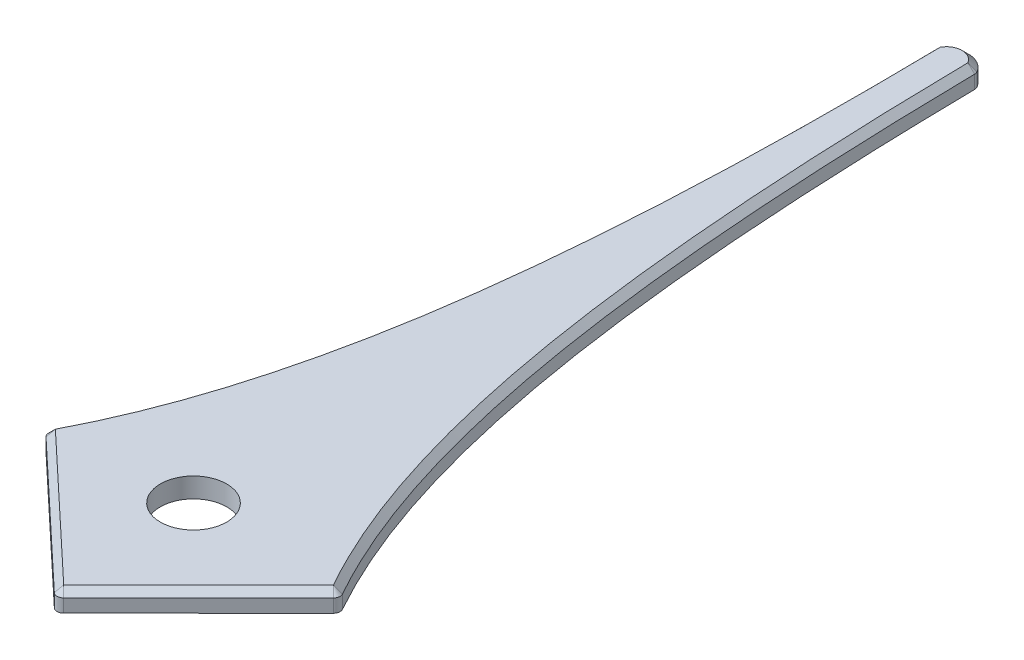
ISO-10303-21;
HEADER;
FILE_DESCRIPTION(('STEP AP214'),'2;1');
FILE_NAME('part.step','',(''),(''),'','','');
FILE_SCHEMA(('AUTOMOTIVE_DESIGN { 1 0 10303 214 1 1 1 1 }'));
ENDSEC;
DATA;
#1=APPLICATION_CONTEXT('core data for automotive mechanical design processes');
#2=APPLICATION_PROTOCOL_DEFINITION('international standard','automotive_design',2000,#1);
#3=PRODUCT_CONTEXT('',#1,'mechanical');
#4=PRODUCT('Part','Part','',(#3));
#5=PRODUCT_RELATED_PRODUCT_CATEGORY('part','',(#4));
#6=PRODUCT_DEFINITION_FORMATION('','',#4);
#7=PRODUCT_DEFINITION_CONTEXT('part definition',#1,'design');
#8=PRODUCT_DEFINITION('design','',#6,#7);
#9=PRODUCT_DEFINITION_SHAPE('','',#8);
#10=(LENGTH_UNIT() NAMED_UNIT(*) SI_UNIT(.MILLI.,.METRE.));
#11=(NAMED_UNIT(*) PLANE_ANGLE_UNIT() SI_UNIT($,.RADIAN.));
#12=(NAMED_UNIT(*) SI_UNIT($,.STERADIAN.) SOLID_ANGLE_UNIT());
#13=UNCERTAINTY_MEASURE_WITH_UNIT(LENGTH_MEASURE(1.E-05),#10,'distance_accuracy_value','');
#14=(GEOMETRIC_REPRESENTATION_CONTEXT(3) GLOBAL_UNCERTAINTY_ASSIGNED_CONTEXT((#13)) GLOBAL_UNIT_ASSIGNED_CONTEXT((#10,
#11,#12)) REPRESENTATION_CONTEXT('',''));
#15=CARTESIAN_POINT('',(0.,0.,0.));
#16=DIRECTION('',(0.,0.,1.));
#17=DIRECTION('',(1.,0.,0.));
#18=AXIS2_PLACEMENT_3D('',#15,#16,#17);
#19=CARTESIAN_POINT('',(-0.84427339324463,0.781119019034748,10.3159980699105));
#20=CARTESIAN_POINT('',(-0.482807728251816,0.781119019034748,9.63484541938807));
#21=CARTESIAN_POINT('',(-0.316238720875581,0.781119019034748,8.60682836334096));
#22=CARTESIAN_POINT('',(-0.344928680809462,0.781119019034748,6.89122524216324));
#23=B_SPLINE_CURVE_WITH_KNOTS('',3,(#19,#20,#21,#22),.UNSPECIFIED.,.F.,.F.,(4,4),(0.,1.),.UNSPECIFIED.);
#24=DIRECTION('',(0.,-1.,0.));
#25=VECTOR('',#24,1.);
#26=SURFACE_OF_LINEAR_EXTRUSION('',#23,#25);
#27=DIRECTION('',(0.,-1.,0.));
#28=VECTOR('',#27,1.);
#29=CARTESIAN_POINT('',(-0.833990106525606,0.693399019034748,10.2964251031646));
#30=LINE('',#29,#28);
#31=CARTESIAN_POINT('',(-0.833990106525606,0.693399019034748,10.2964251031646));
#32=VERTEX_POINT('',#31);
#33=CARTESIAN_POINT('',(-0.833990106525606,0.751879019034748,10.2964251031646));
#34=VERTEX_POINT('',#33);
#35=EDGE_CURVE('E183',#32,#34,#30,.F.);
#36=ORIENTED_EDGE('',*,*,#35,.T.);
#37=CARTESIAN_POINT('',(-0.833990106525606,0.751879019034749,10.2964251031646));
#38=CARTESIAN_POINT('',(-0.480137373854941,0.751879019034749,9.6161219200585));
#39=CARTESIAN_POINT('',(-0.316961311436214,0.751879019034749,8.59329344205403));
#40=CARTESIAN_POINT('',(-0.344812516242735,0.751879019034749,6.89823283345259));
#41=B_SPLINE_CURVE_WITH_KNOTS('',3,(#37,#38,#39,#40),.UNSPECIFIED.,.F.,.F.,(4,4),
(0.00953194338408838,0.998637715516818),.UNSPECIFIED.);
#42=CARTESIAN_POINT('',(-0.344812516242735,0.751879019034748,6.89823283345259));
#43=VERTEX_POINT('',#42);
#44=EDGE_CURVE('E487',#34,#43,#41,.T.);
#45=ORIENTED_EDGE('',*,*,#44,.T.);
#46=DIRECTION('',(0.,-1.,0.));
#47=VECTOR('',#46,1.);
#48=CARTESIAN_POINT('',(-0.344812516242735,0.781119019034748,6.89823283345259));
#49=LINE('',#48,#47);
#50=CARTESIAN_POINT('',(-0.344812516242735,0.693399019034748,6.89823283345259));
#51=VERTEX_POINT('',#50);
#52=EDGE_CURVE('E489',#43,#51,#49,.T.);
#53=ORIENTED_EDGE('',*,*,#52,.T.);
#54=CARTESIAN_POINT('',(-0.84427339324463,0.693399019034748,10.3159980699105));
#55=CARTESIAN_POINT('',(-0.482807728251816,0.693399019034748,9.63484541938807));
#56=CARTESIAN_POINT('',(-0.316238720875581,0.693399019034748,8.60682836334096));
#57=CARTESIAN_POINT('',(-0.344928680809462,0.693399019034748,6.89122524216324));
#58=B_SPLINE_CURVE_WITH_KNOTS('',3,(#54,#55,#56,#57),.UNSPECIFIED.,.F.,.F.,(4,4),(0.,1.),.UNSPECIFIED.);
#59=EDGE_CURVE('E138',#32,#51,#58,.T.);
#60=ORIENTED_EDGE('',*,*,#59,.F.);
#61=EDGE_LOOP('',(#36,#45,#53,#60));
#62=FACE_BOUND('',#61,.T.);
#63=ADVANCED_FACE('F36',(#62),#26,.T.);
#64=CARTESIAN_POINT('',(-2.99700158061435,0.781119019034748,8.29250056360764));
#65=DIRECTION('',(-0.684897970978588,0.,0.728638984236647));
#66=DIRECTION('',(0.728638984236647,0.,0.684897970978588));
#67=AXIS2_PLACEMENT_3D('',#64,#65,#66);
#68=PLANE('',#67);
#69=DIRECTION('',(0.,-1.,0.));
#70=VECTOR('',#69,1.);
#71=CARTESIAN_POINT('',(-0.214885813562541,0.781119019034748,10.9076028091697));
#72=LINE('',#71,#70);
#73=CARTESIAN_POINT('',(-0.214885813562542,0.693399019034748,10.9076028091697));
#74=VERTEX_POINT('',#73);
#75=CARTESIAN_POINT('',(-0.214885813562541,0.751879019034748,10.9076028091697));
#76=VERTEX_POINT('',#75);
#77=EDGE_CURVE('E491',#74,#76,#72,.F.);
#78=ORIENTED_EDGE('',*,*,#77,.T.);
#79=DIRECTION('',(-0.728638984236647,0.,-0.684897970978588));
#80=VECTOR('',#79,1.);
#81=CARTESIAN_POINT('',(-2.99700158061435,0.751879019034747,8.29250056360764));
#82=LINE('',#81,#80);
#83=CARTESIAN_POINT('',(-0.828075788039018,0.751879019034747,10.3312233147575));
#84=VERTEX_POINT('',#83);
#85=EDGE_CURVE('E430',#76,#84,#82,.T.);
#86=ORIENTED_EDGE('',*,*,#85,.T.);
#87=DIRECTION('',(0.,-1.,0.));
#88=VECTOR('',#87,1.);
#89=CARTESIAN_POINT('',(-0.828075788039018,0.781119019034748,10.3312233147575));
#90=LINE('',#89,#88);
#91=CARTESIAN_POINT('',(-0.828075788039018,0.693399019034748,10.3312233147575));
#92=VERTEX_POINT('',#91);
#93=EDGE_CURVE('E504',#84,#92,#90,.T.);
#94=ORIENTED_EDGE('',*,*,#93,.T.);
#95=DIRECTION('',(-0.728638984236647,0.,-0.684897970978588));
#96=VECTOR('',#95,1.);
#97=CARTESIAN_POINT('',(-2.99700158061435,0.693399019034748,8.29250056360764));
#98=LINE('',#97,#96);
#99=EDGE_CURVE('E222',#74,#92,#98,.T.);
#100=ORIENTED_EDGE('',*,*,#99,.F.);
#101=EDGE_LOOP('',(#78,#86,#94,#100));
#102=FACE_BOUND('',#101,.T.);
#103=ADVANCED_FACE('F508',(#102),#68,.T.);
#104=CARTESIAN_POINT('',(-0.850072535414796,0.781119019034748,11.5820228825341));
#105=DIRECTION('',(-0.706667353058945,0.,-0.707545936403188));
#106=DIRECTION('',(-0.707545936403188,0.,0.706667353058945));
#107=AXIS2_PLACEMENT_3D('',#104,#105,#106);
#108=PLANE('',#107);
#109=DIRECTION('',(0.,-1.,0.));
#110=VECTOR('',#109,1.);
#111=CARTESIAN_POINT('',(0.421242565500472,0.781119019034748,10.3122864159032));
#112=LINE('',#111,#110);
#113=CARTESIAN_POINT('',(0.421242565500472,0.693399019034748,10.3122864159032));
#114=VERTEX_POINT('',#113);
#115=CARTESIAN_POINT('',(0.421242565500472,0.751879019034748,10.3122864159032));
#116=VERTEX_POINT('',#115);
#117=EDGE_CURVE('E495',#114,#116,#112,.F.);
#118=ORIENTED_EDGE('',*,*,#117,.T.);
#119=DIRECTION('',(-0.707545936403188,0.,0.706667353058945));
#120=VECTOR('',#119,1.);
#121=CARTESIAN_POINT('',(-0.174196443487683,0.751879019034749,10.9069860484511));
#122=LINE('',#121,#120);
#123=CARTESIAN_POINT('',(-0.174196443487683,0.751879019034748,10.9069860484511));
#124=VERTEX_POINT('',#123);
#125=EDGE_CURVE('E437',#116,#124,#122,.T.);
#126=ORIENTED_EDGE('',*,*,#125,.T.);
#127=DIRECTION('',(0.,-1.,0.));
#128=VECTOR('',#127,1.);
#129=CARTESIAN_POINT('',(-0.174196443487683,0.693399019034748,10.9069860484511));
#130=LINE('',#129,#128);
#131=CARTESIAN_POINT('',(-0.174196443487683,0.693399019034748,10.9069860484511));
#132=VERTEX_POINT('',#131);
#133=EDGE_CURVE('E493',#124,#132,#130,.T.);
#134=ORIENTED_EDGE('',*,*,#133,.T.);
#135=DIRECTION('',(0.707545936403188,0.,-0.706667353058945));
#136=VECTOR('',#135,1.);
#137=CARTESIAN_POINT('',(-0.850072535414796,0.693399019034748,11.5820228825341));
#138=LINE('',#137,#136);
#139=EDGE_CURVE('E229',#132,#114,#138,.T.);
#140=ORIENTED_EDGE('',*,*,#139,.T.);
#141=EDGE_LOOP('',(#118,#126,#134,#140));
#142=FACE_BOUND('',#141,.T.);
#143=ADVANCED_FACE('F204',(#142),#108,.F.);
#144=CARTESIAN_POINT('',(0.436971273393723,0.781119019034748,10.2965772388702));
#145=CARTESIAN_POINT('',(0.0550268824383199,0.781119019034748,9.62669303805619));
#146=CARTESIAN_POINT('',(-0.142623365273902,0.781119019034748,8.60419673912823));
#147=CARTESIAN_POINT('',(-0.165944125072515,0.781119019034748,6.88851223276986));
#148=B_SPLINE_CURVE_WITH_KNOTS('',3,(#144,#145,#146,#147),.UNSPECIFIED.,.F.,.F.,(4,4),(0.,1.),.UNSPECIFIED.);
#149=DIRECTION('',(0.,-1.,0.));
#150=VECTOR('',#149,1.);
#151=SURFACE_OF_LINEAR_EXTRUSION('',#148,#150);
#152=DIRECTION('',(0.,-1.,0.));
#153=VECTOR('',#152,1.);
#154=CARTESIAN_POINT('',(-0.165847845947759,0.693399019034748,6.89552012547847));
#155=LINE('',#154,#153);
#156=CARTESIAN_POINT('',(-0.165847845947759,0.693399019034748,6.89552012547847));
#157=VERTEX_POINT('',#156);
#158=CARTESIAN_POINT('',(-0.165847845947759,0.751879019034748,6.89552012547847));
#159=VERTEX_POINT('',#158);
#160=EDGE_CURVE('E175',#157,#159,#155,.F.);
#161=ORIENTED_EDGE('',*,*,#160,.T.);
#162=CARTESIAN_POINT('',(-0.165847845947759,0.751879019034748,6.89552012547847));
#163=CARTESIAN_POINT('',(-0.142311331277567,0.751879019034748,8.59064613522483));
#164=CARTESIAN_POINT('',(0.0517902716663454,0.751879019034748,9.60805907523397));
#165=CARTESIAN_POINT('',(0.426099481593648,0.751879019034748,10.2773249362536));
#166=B_SPLINE_CURVE_WITH_KNOTS('',3,(#162,#163,#164,#165),.UNSPECIFIED.,.F.,.F.,(4,4),
(0.00953194338408858,0.998637715516818),.UNSPECIFIED.);
#167=CARTESIAN_POINT('',(0.426099481593648,0.75187901903475,10.2773249362536));
#168=VERTEX_POINT('',#167);
#169=EDGE_CURVE('E11',#159,#168,#166,.T.);
#170=ORIENTED_EDGE('',*,*,#169,.T.);
#171=DIRECTION('',(0.,-1.,0.));
#172=VECTOR('',#171,1.);
#173=CARTESIAN_POINT('',(0.426099481593648,0.781119019034748,10.2773249362536));
#174=LINE('',#173,#172);
#175=CARTESIAN_POINT('',(0.426099481593648,0.693399019034748,10.2773249362536));
#176=VERTEX_POINT('',#175);
#177=EDGE_CURVE('E167',#168,#176,#174,.T.);
#178=ORIENTED_EDGE('',*,*,#177,.T.);
#179=CARTESIAN_POINT('',(0.436971273393723,0.693399019034748,10.2965772388702));
#180=CARTESIAN_POINT('',(0.0550268824383199,0.693399019034748,9.62669303805619));
#181=CARTESIAN_POINT('',(-0.142623365273902,0.693399019034748,8.60419673912823));
#182=CARTESIAN_POINT('',(-0.165944125072515,0.693399019034748,6.88851223276986));
#183=B_SPLINE_CURVE_WITH_KNOTS('',3,(#179,#180,#181,#182),.UNSPECIFIED.,.F.,.F.,(4,4),(0.,1.),.UNSPECIFIED.);
#184=EDGE_CURVE('E152',#176,#157,#183,.T.);
#185=ORIENTED_EDGE('',*,*,#184,.T.);
#186=EDGE_LOOP('',(#161,#170,#178,#185));
#187=FACE_BOUND('',#186,.T.);
#188=ADVANCED_FACE('F193',(#187),#151,.F.);
#189=CARTESIAN_POINT('',(-0.25481325555267,0.781119019034748,6.93097945338565));
#190=DIRECTION('',(0.,-1.,0.));
#191=DIRECTION('',(0.,0.,-1.));
#192=AXIS2_PLACEMENT_3D('',#189,#190,#191);
#193=CYLINDRICAL_SURFACE('',#192,0.09849460482244);
#194=DIRECTION('',(0.,-1.,0.));
#195=VECTOR('',#194,1.);
#196=CARTESIAN_POINT('',(-0.341231307663666,0.781119019034748,6.88372368708703));
#197=LINE('',#196,#195);
#198=CARTESIAN_POINT('',(-0.341231307663666,0.693399019034748,6.88372368708703));
#199=VERTEX_POINT('',#198);
#200=CARTESIAN_POINT('',(-0.341231307663666,0.751879019034748,6.88372368708703));
#201=VERTEX_POINT('',#200);
#202=EDGE_CURVE('E148',#199,#201,#197,.F.);
#203=ORIENTED_EDGE('',*,*,#202,.T.);
#204=CARTESIAN_POINT('',(-0.25481325555267,0.751879019034748,6.93097945338565));
#205=DIRECTION('',(0.,1.,0.));
#206=DIRECTION('',(0.,0.,1.));
#207=AXIS2_PLACEMENT_3D('',#204,#205,#206);
#208=CIRCLE('',#207,0.09849460482244);
#209=CARTESIAN_POINT('',(-0.169867161281203,0.751879019034748,6.88112618621938));
#210=VERTEX_POINT('',#209);
#211=EDGE_CURVE('E176',#201,#210,#208,.F.);
#212=ORIENTED_EDGE('',*,*,#211,.T.);
#213=DIRECTION('',(0.,-1.,0.));
#214=VECTOR('',#213,1.);
#215=CARTESIAN_POINT('',(-0.169867161281203,0.781119019034748,6.88112618621938));
#216=LINE('',#215,#214);
#217=CARTESIAN_POINT('',(-0.169867161281203,0.693399019034748,6.88112618621938));
#218=VERTEX_POINT('',#217);
#219=EDGE_CURVE('E150',#210,#218,#216,.T.);
#220=ORIENTED_EDGE('',*,*,#219,.T.);
#221=CARTESIAN_POINT('',(-0.25481325555267,0.693399019034748,6.93097945338565));
#222=DIRECTION('',(0.,1.,0.));
#223=DIRECTION('',(0.,0.,1.));
#224=AXIS2_PLACEMENT_3D('',#221,#222,#223);
#225=CIRCLE('',#224,0.09849460482244);
#226=EDGE_CURVE('E136',#199,#218,#225,.F.);
#227=ORIENTED_EDGE('',*,*,#226,.F.);
#228=EDGE_LOOP('',(#203,#212,#220,#227));
#229=FACE_BOUND('',#228,.T.);
#230=ADVANCED_FACE('F147',(#229),#193,.T.);
#231=CARTESIAN_POINT('',(-3.54899396528739,0.781119019034748,8.87974594542686));
#232=DIRECTION('',(0.,1.,0.));
#233=DIRECTION('',(0.,0.,1.));
#234=AXIS2_PLACEMENT_3D('',#231,#232,#233);
#235=PLANE('',#234);
#236=CARTESIAN_POINT('',(-0.808049371367605,0.781119019034748,10.3099179108584));
#237=CARTESIAN_POINT('',(-0.673071997666404,0.781119019034748,10.0497998542177));
#238=CARTESIAN_POINT('',(-0.582372473716355,0.781119019034748,9.77616981580804));
#239=CARTESIAN_POINT('',(-0.447791912541357,0.781119019034748,9.21532648869756));
#240=CARTESIAN_POINT('',(-0.404337697665234,0.781119019034748,8.92643623887617));
#241=CARTESIAN_POINT('',(-0.344494199605317,0.781119019034748,8.34953784067906));
#242=CARTESIAN_POINT('',(-0.328089215704498,0.781119019034748,8.05924765885427));
#243=CARTESIAN_POINT('',(-0.311154400935458,0.781119019034748,7.47855540265641));
#244=CARTESIAN_POINT('',(-0.310834637859471,0.781119019034748,7.18820162085901));
#245=CARTESIAN_POINT('',(-0.315576462423354,0.781119019034748,6.89775246164847));
#246=B_SPLINE_CURVE_WITH_KNOTS('',3,(#236,#237,#238,#239,#240,#241,#242,#243,#244,#245),
.UNSPECIFIED.,.F.,.F.,(4,2,2,2,4),(0.,0.0147760194086552,0.0295520388173104,0.0443280582259656,
0.0591040776346209),.UNSPECIFIED.);
#247=CARTESIAN_POINT('',(-0.315576462423352,0.781119019034748,6.89775246164847));
#248=VERTEX_POINT('',#247);
#249=CARTESIAN_POINT('',(-0.808049371367605,0.781119019034748,10.3099179108584));
#250=VERTEX_POINT('',#249);
#251=EDGE_CURVE('E448',#248,#250,#246,.F.);
#252=ORIENTED_EDGE('',*,*,#251,.T.);
#253=DIRECTION('',(0.728638984236647,0.,0.684897970978588));
#254=VECTOR('',#253,1.);
#255=CARTESIAN_POINT('',(-2.97697516394293,0.781119019034748,8.27119515970856));
#256=LINE('',#255,#254);
#257=CARTESIAN_POINT('',(-0.194859396891127,0.781119019034748,10.8862974052706));
#258=VERTEX_POINT('',#257);
#259=EDGE_CURVE('E428',#250,#258,#256,.T.);
#260=ORIENTED_EDGE('',*,*,#259,.T.);
#261=DIRECTION('',(0.707545936403188,0.,-0.706667353058945));
#262=VECTOR('',#261,1.);
#263=CARTESIAN_POINT('',(0.400579612097029,0.781119019034748,10.2915977727228));
#264=LINE('',#263,#262);
#265=CARTESIAN_POINT('',(0.400579612097027,0.781119019034748,10.2915977727228));
#266=VERTEX_POINT('',#265);
#267=EDGE_CURVE('E478',#258,#266,#264,.T.);
#268=ORIENTED_EDGE('',*,*,#267,.T.);
#269=CARTESIAN_POINT('',(-0.195085027792525,0.781119019034748,6.895926078402));
#270=CARTESIAN_POINT('',(-0.191023795240976,0.781119019034748,7.1862414369228));
#271=CARTESIAN_POINT('',(-0.181902087033121,0.781119019034748,7.47636203373418));
#272=CARTESIAN_POINT('',(-0.147440068846124,0.781119019034748,8.05563778441213));
#273=CARTESIAN_POINT('',(-0.12224479143337,0.781119019034748,8.34557794355415));
#274=CARTESIAN_POINT('',(-0.0450386576660064,0.781119019034748,8.91989274421253));
#275=CARTESIAN_POINT('',(0.00695766309965723,0.781119019034748,9.20691727088983));
#276=CARTESIAN_POINT('',(0.159007370220995,0.781119019034748,9.76579722101433));
#277=CARTESIAN_POINT('',(0.258140563916696,0.781119019034748,10.0363820216979));
#278=CARTESIAN_POINT('',(0.400579612097027,0.781119019034748,10.2915977727228));
#279=B_SPLINE_CURVE_WITH_KNOTS('',3,(#269,#270,#271,#272,#273,#274,#275,#276,#277,#278),
.UNSPECIFIED.,.F.,.F.,(4,2,2,2,4),(0.,0.0148859978871837,0.0297719957743674,0.0446579936615511,
0.0595439915487348),.UNSPECIFIED.);
#280=CARTESIAN_POINT('',(-0.195085027792525,0.781119019034748,6.895926078402));
#281=VERTEX_POINT('',#280);
#282=EDGE_CURVE('E411',#266,#281,#279,.F.);
#283=ORIENTED_EDGE('',*,*,#282,.T.);
#284=CARTESIAN_POINT('',(-0.25481325555267,0.781119019034748,6.93097945338565));
#285=DIRECTION('',(0.,1.,0.));
#286=DIRECTION('',(0.,0.,1.));
#287=AXIS2_PLACEMENT_3D('',#284,#285,#286);
#288=CIRCLE('',#287,0.0692546048224396);
#289=EDGE_CURVE('E254',#281,#248,#288,.T.);
#290=ORIENTED_EDGE('',*,*,#289,.T.);
#291=EDGE_LOOP('',(#252,#260,#268,#283,#290));
#292=FACE_BOUND('',#291,.T.);
#293=CARTESIAN_POINT('',(-0.221192362567505,0.781119019034748,10.2871364467844));
#294=DIRECTION('',(0.,1.,0.));
#295=DIRECTION('',(0.,0.,1.));
#296=AXIS2_PLACEMENT_3D('',#293,#294,#295);
#297=CIRCLE('',#296,0.1462);
#298=CARTESIAN_POINT('',(-0.221192362567505,0.781119019034748,10.4333364467844));
#299=VERTEX_POINT('',#298);
#300=EDGE_CURVE('E415',#299,#299,#297,.T.);
#301=ORIENTED_EDGE('',*,*,#300,.F.);
#302=EDGE_LOOP('',(#301));
#303=FACE_BOUND('',#302,.T.);
#304=ADVANCED_FACE('F454',(#292,#303),#235,.T.);
#305=CARTESIAN_POINT('',(-3.54899396528739,0.693399019034748,8.87974594542686));
#306=DIRECTION('',(0.,1.,0.));
#307=DIRECTION('',(0.,0.,1.));
#308=AXIS2_PLACEMENT_3D('',#305,#306,#307);
#309=PLANE('',#308);
#310=CARTESIAN_POINT('',(-0.221192362567505,0.693399019034748,10.2871364467844));
#311=DIRECTION('',(0.,1.,0.));
#312=DIRECTION('',(0.,0.,1.));
#313=AXIS2_PLACEMENT_3D('',#310,#311,#312);
#314=CIRCLE('',#313,0.1462);
#315=CARTESIAN_POINT('',(-0.221192362567505,0.693399019034748,10.4333364467844));
#316=VERTEX_POINT('',#315);
#317=EDGE_CURVE('E223',#316,#316,#314,.T.);
#318=ORIENTED_EDGE('',*,*,#317,.T.);
#319=EDGE_LOOP('',(#318));
#320=FACE_BOUND('',#319,.T.);
#321=ORIENTED_EDGE('',*,*,#226,.T.);
#322=CARTESIAN_POINT('',(-0.195085027792524,0.693399019034748,6.895926078402));
#323=DIRECTION('',(0.,1.,0.));
#324=DIRECTION('',(0.,0.,1.));
#325=AXIS2_PLACEMENT_3D('',#322,#323,#324);
#326=CIRCLE('',#325,0.02924);
#327=EDGE_CURVE('E142',#218,#157,#326,.F.);
#328=ORIENTED_EDGE('',*,*,#327,.T.);
#329=ORIENTED_EDGE('',*,*,#184,.F.);
#330=CARTESIAN_POINT('',(0.400579612097028,0.693399019034748,10.2915977727228));
#331=DIRECTION('',(0.,1.,0.));
#332=DIRECTION('',(0.,0.,1.));
#333=AXIS2_PLACEMENT_3D('',#330,#331,#332);
#334=CIRCLE('',#333,0.02924);
#335=EDGE_CURVE('E143',#176,#114,#334,.F.);
#336=ORIENTED_EDGE('',*,*,#335,.T.);
#337=ORIENTED_EDGE('',*,*,#139,.F.);
#338=CARTESIAN_POINT('',(-0.194859396891127,0.693399019034748,10.8862974052706));
#339=DIRECTION('',(0.,1.,0.));
#340=DIRECTION('',(0.,0.,1.));
#341=AXIS2_PLACEMENT_3D('',#338,#339,#340);
#342=CIRCLE('',#341,0.02924);
#343=EDGE_CURVE('E163',#132,#74,#342,.F.);
#344=ORIENTED_EDGE('',*,*,#343,.T.);
#345=ORIENTED_EDGE('',*,*,#99,.T.);
#346=CARTESIAN_POINT('',(-0.808049371367604,0.693399019034748,10.3099179108584));
#347=DIRECTION('',(0.,1.,0.));
#348=DIRECTION('',(0.,0.,1.));
#349=AXIS2_PLACEMENT_3D('',#346,#347,#348);
#350=CIRCLE('',#349,0.02924);
#351=EDGE_CURVE('E158',#92,#32,#350,.F.);
#352=ORIENTED_EDGE('',*,*,#351,.T.);
#353=ORIENTED_EDGE('',*,*,#59,.T.);
#354=CARTESIAN_POINT('',(-0.315576462423353,0.693399019034748,6.89775246164847));
#355=DIRECTION('',(0.,1.,0.));
#356=DIRECTION('',(0.,0.,1.));
#357=AXIS2_PLACEMENT_3D('',#354,#355,#356);
#358=CIRCLE('',#357,0.02924);
#359=EDGE_CURVE('E133',#51,#199,#358,.F.);
#360=ORIENTED_EDGE('',*,*,#359,.T.);
#361=EDGE_LOOP('',(#321,#328,#329,#336,#337,#344,#345,#352,#353,#360));
#362=FACE_BOUND('',#361,.T.);
#363=ADVANCED_FACE('F135',(#320,#362),#309,.F.);
#364=CARTESIAN_POINT('',(-0.195085027792524,0.737259019034748,6.895926078402));
#365=DIRECTION('',(0.,-1.,0.));
#366=DIRECTION('',(0.,0.,-1.));
#367=AXIS2_PLACEMENT_3D('',#364,#365,#366);
#368=CYLINDRICAL_SURFACE('',#367,0.02924);
#369=ORIENTED_EDGE('',*,*,#219,.F.);
#370=CARTESIAN_POINT('',(-0.195085027792524,0.751879019034748,6.895926078402));
#371=DIRECTION('',(0.,1.,0.));
#372=DIRECTION('',(0.,0.,1.));
#373=AXIS2_PLACEMENT_3D('',#370,#371,#372);
#374=CIRCLE('',#373,0.02924);
#375=EDGE_CURVE('E48',#210,#159,#374,.F.);
#376=ORIENTED_EDGE('',*,*,#375,.T.);
#377=ORIENTED_EDGE('',*,*,#160,.F.);
#378=ORIENTED_EDGE('',*,*,#327,.F.);
#379=EDGE_LOOP('',(#369,#376,#377,#378));
#380=FACE_BOUND('',#379,.T.);
#381=ADVANCED_FACE('F239',(#380),#368,.T.);
#382=CARTESIAN_POINT('',(-0.315576462423353,0.737259019034748,6.89775246164847));
#383=DIRECTION('',(0.,-1.,0.));
#384=DIRECTION('',(0.,0.,-1.));
#385=AXIS2_PLACEMENT_3D('',#382,#383,#384);
#386=CYLINDRICAL_SURFACE('',#385,0.02924);
#387=ORIENTED_EDGE('',*,*,#52,.F.);
#388=CARTESIAN_POINT('',(-0.315576462423353,0.751879019034748,6.89775246164847));
#389=DIRECTION('',(0.,1.,0.));
#390=DIRECTION('',(0.,0.,1.));
#391=AXIS2_PLACEMENT_3D('',#388,#389,#390);
#392=CIRCLE('',#391,0.02924);
#393=EDGE_CURVE('E156',#43,#201,#392,.F.);
#394=ORIENTED_EDGE('',*,*,#393,.T.);
#395=ORIENTED_EDGE('',*,*,#202,.F.);
#396=ORIENTED_EDGE('',*,*,#359,.F.);
#397=EDGE_LOOP('',(#387,#394,#395,#396));
#398=FACE_BOUND('',#397,.T.);
#399=ADVANCED_FACE('F154',(#398),#386,.T.);
#400=CARTESIAN_POINT('',(0.400579612097028,0.737259019034748,10.2915977727228));
#401=DIRECTION('',(0.,-1.,0.));
#402=DIRECTION('',(0.,0.,-1.));
#403=AXIS2_PLACEMENT_3D('',#400,#401,#402);
#404=CYLINDRICAL_SURFACE('',#403,0.02924);
#405=ORIENTED_EDGE('',*,*,#177,.F.);
#406=CARTESIAN_POINT('',(0.400579612097028,0.751879019034748,10.2915977727228));
#407=DIRECTION('',(0.,1.,0.));
#408=DIRECTION('',(0.,0.,1.));
#409=AXIS2_PLACEMENT_3D('',#406,#407,#408);
#410=CIRCLE('',#409,0.02924);
#411=EDGE_CURVE('E178',#168,#116,#410,.F.);
#412=ORIENTED_EDGE('',*,*,#411,.T.);
#413=ORIENTED_EDGE('',*,*,#117,.F.);
#414=ORIENTED_EDGE('',*,*,#335,.F.);
#415=EDGE_LOOP('',(#405,#412,#413,#414));
#416=FACE_BOUND('',#415,.T.);
#417=ADVANCED_FACE('F517',(#416),#404,.T.);
#418=CARTESIAN_POINT('',(-0.194859396891127,0.781119019034748,10.8862974052706));
#419=DIRECTION('',(0.,1.,0.));
#420=DIRECTION('',(0.,0.,1.));
#421=AXIS2_PLACEMENT_3D('',#418,#419,#420);
#422=CYLINDRICAL_SURFACE('',#421,0.02924);
#423=ORIENTED_EDGE('',*,*,#133,.F.);
#424=CARTESIAN_POINT('',(-0.194859396891127,0.751879019034748,10.8862974052706));
#425=DIRECTION('',(0.,1.,0.));
#426=DIRECTION('',(0.,0.,1.));
#427=AXIS2_PLACEMENT_3D('',#424,#425,#426);
#428=CIRCLE('',#427,0.02924);
#429=EDGE_CURVE('E422',#124,#76,#428,.F.);
#430=ORIENTED_EDGE('',*,*,#429,.T.);
#431=ORIENTED_EDGE('',*,*,#77,.F.);
#432=ORIENTED_EDGE('',*,*,#343,.F.);
#433=EDGE_LOOP('',(#423,#430,#431,#432));
#434=FACE_BOUND('',#433,.T.);
#435=ADVANCED_FACE('F512',(#434),#422,.T.);
#436=CARTESIAN_POINT('',(-0.808049371367604,0.737259019034748,10.3099179108584));
#437=DIRECTION('',(0.,-1.,0.));
#438=DIRECTION('',(0.,0.,-1.));
#439=AXIS2_PLACEMENT_3D('',#436,#437,#438);
#440=CYLINDRICAL_SURFACE('',#439,0.02924);
#441=ORIENTED_EDGE('',*,*,#93,.F.);
#442=CARTESIAN_POINT('',(-0.808049371367604,0.751879019034748,10.3099179108584));
#443=DIRECTION('',(0.,1.,0.));
#444=DIRECTION('',(0.,0.,1.));
#445=AXIS2_PLACEMENT_3D('',#442,#443,#444);
#446=CIRCLE('',#445,0.02924);
#447=EDGE_CURVE('E434',#84,#34,#446,.F.);
#448=ORIENTED_EDGE('',*,*,#447,.T.);
#449=ORIENTED_EDGE('',*,*,#35,.F.);
#450=ORIENTED_EDGE('',*,*,#351,.F.);
#451=EDGE_LOOP('',(#441,#448,#449,#450));
#452=FACE_BOUND('',#451,.T.);
#453=ADVANCED_FACE('F297',(#452),#440,.T.);
#454=CARTESIAN_POINT('',(-0.221192362567505,0.693399019034748,10.2871364467844));
#455=DIRECTION('',(0.,1.,0.));
#456=DIRECTION('',(0.,0.,1.));
#457=AXIS2_PLACEMENT_3D('',#454,#455,#456);
#458=CYLINDRICAL_SURFACE('',#457,0.1462);
#459=ORIENTED_EDGE('',*,*,#317,.F.);
#460=EDGE_LOOP('',(#459));
#461=FACE_BOUND('',#460,.T.);
#462=ORIENTED_EDGE('',*,*,#300,.T.);
#463=EDGE_LOOP('',(#462));
#464=FACE_BOUND('',#463,.T.);
#465=ADVANCED_FACE('F464',(#461,#464),#458,.F.);
#466=CARTESIAN_POINT('',(0.400579612097028,0.751879019034748,10.2915977727228));
#467=DIRECTION('',(0.,-1.,0.));
#468=DIRECTION('',(0.,0.,-1.));
#469=AXIS2_PLACEMENT_3D('',#466,#467,#468);
#470=CONICAL_SURFACE('',#469,0.0292400000000005,0.78539816339745);
#471=CARTESIAN_POINT('',(0.400579612097027,0.781119019034748,10.2915977727228));
#472=CARTESIAN_POINT('',(0.426099481593648,0.751879019034748,10.2773249362536));
#473=B_SPLINE_CURVE_WITH_KNOTS('',1,(#471,#472),.UNSPECIFIED.,.F.,.F.,(2,2),(0.,1.),.UNSPECIFIED.);
#474=EDGE_CURVE('E403',#266,#168,#473,.T.);
#475=ORIENTED_EDGE('',*,*,#474,.F.);
#476=DIRECTION('',(-0.499689277391123,0.707106781186555,-0.500310529631673));
#477=VECTOR('',#476,1.);
#478=CARTESIAN_POINT('',(0.421242565500472,0.751879019034748,10.3122864159032));
#479=LINE('',#478,#477);
#480=EDGE_CURVE('E412',#116,#266,#479,.T.);
#481=ORIENTED_EDGE('',*,*,#480,.F.);
#482=ORIENTED_EDGE('',*,*,#411,.F.);
#483=EDGE_LOOP('',(#475,#481,#482));
#484=FACE_BOUND('',#483,.T.);
#485=ADVANCED_FACE('F38',(#484),#470,.T.);
#486=CARTESIAN_POINT('',(-0.870735488818239,0.781119019034748,11.5613342393537));
#487=DIRECTION('',(0.499689277391128,0.707106781186548,0.500310529631679));
#488=DIRECTION('',(0.,-0.577589240790984,0.816327550020514));
#489=AXIS2_PLACEMENT_3D('',#486,#487,#488);
#490=PLANE('',#489);
#491=ORIENTED_EDGE('',*,*,#480,.T.);
#492=ORIENTED_EDGE('',*,*,#267,.F.);
#493=DIRECTION('',(-0.499689277391127,0.707106781186548,-0.500310529631681));
#494=VECTOR('',#493,1.);
#495=CARTESIAN_POINT('',(-0.174196443487683,0.751879019034749,10.9069860484511));
#496=LINE('',#495,#494);
#497=EDGE_CURVE('E413',#124,#258,#496,.T.);
#498=ORIENTED_EDGE('',*,*,#497,.F.);
#499=ORIENTED_EDGE('',*,*,#125,.F.);
#500=EDGE_LOOP('',(#491,#492,#498,#499));
#501=FACE_BOUND('',#500,.T.);
#502=ADVANCED_FACE('F376',(#501),#490,.T.);
#503=CARTESIAN_POINT('',(0.400579612097027,0.781119019034748,10.2915977727228));
#504=CARTESIAN_POINT('',(0.258140563916696,0.781119019034748,10.0363820216979));
#505=CARTESIAN_POINT('',(0.159007370220995,0.781119019034748,9.76579722101433));
#506=CARTESIAN_POINT('',(0.00695766309965723,0.781119019034748,9.20691727088983));
#507=CARTESIAN_POINT('',(-0.0450386576660064,0.781119019034748,8.91989274421253));
#508=CARTESIAN_POINT('',(-0.12224479143337,0.781119019034748,8.34557794355415));
#509=CARTESIAN_POINT('',(-0.147440068846124,0.781119019034748,8.05563778441213));
#510=CARTESIAN_POINT('',(-0.181902087033121,0.781119019034748,7.47636203373418));
#511=CARTESIAN_POINT('',(-0.191023795240976,0.781119019034748,7.1862414369228));
#512=CARTESIAN_POINT('',(-0.195085027792525,0.781119019034748,6.895926078402));
#513=CARTESIAN_POINT('',(0.426099481593648,0.751879019034748,10.2773249362536));
#514=CARTESIAN_POINT('',(0.285188012527798,0.751879019034748,10.0248646827191));
#515=CARTESIAN_POINT('',(0.186769575005268,0.751879019034748,9.75646667480994));
#516=CARTESIAN_POINT('',(0.0356272081590663,0.751879019034748,9.20090610892401));
#517=CARTESIAN_POINT('',(-0.0161850568477021,0.751879019034748,8.91507184997638));
#518=CARTESIAN_POINT('',(-0.0931392011023028,0.751879019034748,8.34261150440134));
#519=CARTESIAN_POINT('',(-0.118284794427199,0.751879019034748,8.05335015738403));
#520=CARTESIAN_POINT('',(-0.152680434832369,0.751879019034748,7.47517909331));
#521=CARTESIAN_POINT('',(-0.161791826577346,0.751879019034748,7.18548081914601));
#522=CARTESIAN_POINT('',(-0.165847845947759,0.751879019034748,6.89552012547847));
#523=B_SPLINE_SURFACE_WITH_KNOTS('',1,3,((#503,#504,#505,#506,#507,#508,#509,#510,#511,#512),
(#513,#514,#515,#516,#517,#518,#519,#520,#521,#522)),.UNSPECIFIED.,.F.,.F.,.F.,(2,2),(4,2,2,2,
4),(0.,1.),(0.,0.0148859978871837,0.0297719957743674,0.0446579936615511,0.0595439915487348),.UNSPECIFIED.);
#524=CARTESIAN_POINT('',(-0.165847845947759,0.751879019034748,6.89552012547847));
#525=CARTESIAN_POINT('',(-0.195085027792525,0.781119019034748,6.895926078402));
#526=B_SPLINE_CURVE_WITH_KNOTS('',1,(#524,#525),.UNSPECIFIED.,.F.,.F.,(2,2),(0.,1.),.UNSPECIFIED.);
#527=EDGE_CURVE('E248',#281,#159,#526,.F.);
#528=ORIENTED_EDGE('',*,*,#474,.T.);
#529=ORIENTED_EDGE('',*,*,#169,.F.);
#530=ORIENTED_EDGE('',*,*,#527,.F.);
#531=ORIENTED_EDGE('',*,*,#282,.F.);
#532=EDGE_LOOP('',(#528,#529,#530,#531));
#533=FACE_BOUND('',#532,.T.);
#534=ADVANCED_FACE('F366',(#533),#523,.T.);
#535=CARTESIAN_POINT('',(-0.194859396891127,0.751879019034748,10.8862974052706));
#536=DIRECTION('',(0.,-1.,0.));
#537=DIRECTION('',(0.,0.,-1.));
#538=AXIS2_PLACEMENT_3D('',#535,#536,#537);
#539=CONICAL_SURFACE('',#538,0.0292400000000005,0.78539816339745);
#540=ORIENTED_EDGE('',*,*,#429,.F.);
#541=ORIENTED_EDGE('',*,*,#497,.T.);
#542=DIRECTION('',(0.484295999699869,0.707106781186548,-0.515225566790609));
#543=VECTOR('',#542,1.);
#544=CARTESIAN_POINT('',(-0.214885813562541,0.751879019034748,10.9076028091697));
#545=LINE('',#544,#543);
#546=EDGE_CURVE('E191',#76,#258,#545,.T.);
#547=ORIENTED_EDGE('',*,*,#546,.F.);
#548=EDGE_LOOP('',(#540,#541,#547));
#549=FACE_BOUND('',#548,.T.);
#550=ADVANCED_FACE('F349',(#549),#539,.T.);
#551=CARTESIAN_POINT('',(-0.195085027792524,0.751879019034748,6.895926078402));
#552=DIRECTION('',(0.,-1.,0.));
#553=DIRECTION('',(0.,0.,-1.));
#554=AXIS2_PLACEMENT_3D('',#551,#552,#553);
#555=CONICAL_SURFACE('',#554,0.0292400000000005,0.78539816339745);
#556=ORIENTED_EDGE('',*,*,#527,.T.);
#557=ORIENTED_EDGE('',*,*,#375,.F.);
#558=DIRECTION('',(0.609840096347917,-0.707106781186539,-0.357903697782484));
#559=VECTOR('',#558,1.);
#560=CARTESIAN_POINT('',(-0.195085027792525,0.781119019034748,6.895926078402));
#561=LINE('',#560,#559);
#562=EDGE_CURVE('E245',#281,#210,#561,.T.);
#563=ORIENTED_EDGE('',*,*,#562,.F.);
#564=EDGE_LOOP('',(#556,#557,#563));
#565=FACE_BOUND('',#564,.T.);
#566=ADVANCED_FACE('F244',(#565),#555,.T.);
#567=CARTESIAN_POINT('',(-2.99700158061435,0.751879019034748,8.29250056360764));
#568=DIRECTION('',(0.484295999699868,-0.707106781186546,-0.515225566790612));
#569=DIRECTION('',(0.,0.588893684828165,-0.80821050968761));
#570=AXIS2_PLACEMENT_3D('',#567,#568,#569);
#571=PLANE('',#570);
#572=ORIENTED_EDGE('',*,*,#546,.T.);
#573=ORIENTED_EDGE('',*,*,#259,.F.);
#574=DIRECTION('',(0.484295999699863,0.707106781186545,-0.515225566790618));
#575=VECTOR('',#574,1.);
#576=CARTESIAN_POINT('',(-0.828075788039018,0.751879019034747,10.3312233147575));
#577=LINE('',#576,#575);
#578=EDGE_CURVE('E255',#84,#250,#577,.T.);
#579=ORIENTED_EDGE('',*,*,#578,.F.);
#580=ORIENTED_EDGE('',*,*,#85,.F.);
#581=EDGE_LOOP('',(#572,#573,#579,#580));
#582=FACE_BOUND('',#581,.T.);
#583=ADVANCED_FACE('F342',(#582),#571,.F.);
#584=CARTESIAN_POINT('',(-0.25481325555267,0.751879019034748,6.93097945338565));
#585=DIRECTION('',(0.,-1.,0.));
#586=DIRECTION('',(0.,0.,-1.));
#587=AXIS2_PLACEMENT_3D('',#584,#585,#586);
#588=CONICAL_SURFACE('',#587,0.09849460482244,0.78539816339745);
#589=ORIENTED_EDGE('',*,*,#562,.T.);
#590=ORIENTED_EDGE('',*,*,#211,.F.);
#591=DIRECTION('',(-0.620407491098395,-0.707106781186547,-0.339255869498223));
#592=VECTOR('',#591,1.);
#593=CARTESIAN_POINT('',(-0.315576462423352,0.781119019034748,6.89775246164847));
#594=LINE('',#593,#592);
#595=EDGE_CURVE('E259',#248,#201,#594,.T.);
#596=ORIENTED_EDGE('',*,*,#595,.F.);
#597=ORIENTED_EDGE('',*,*,#289,.F.);
#598=EDGE_LOOP('',(#589,#590,#596,#597));
#599=FACE_BOUND('',#598,.T.);
#600=ADVANCED_FACE('F251',(#599),#588,.T.);
#601=CARTESIAN_POINT('',(-0.808049371367604,0.751879019034748,10.3099179108584));
#602=DIRECTION('',(0.,-1.,0.));
#603=DIRECTION('',(0.,0.,-1.));
#604=AXIS2_PLACEMENT_3D('',#601,#602,#603);
#605=CONICAL_SURFACE('',#604,0.0292400000000005,0.78539816339745);
#606=ORIENTED_EDGE('',*,*,#447,.F.);
#607=ORIENTED_EDGE('',*,*,#578,.T.);
#608=CARTESIAN_POINT('',(-0.833990106525606,0.751879019034749,10.2964251031646));
#609=CARTESIAN_POINT('',(-0.808049371367605,0.781119019034748,10.3099179108584));
#610=B_SPLINE_CURVE_WITH_KNOTS('',1,(#608,#609),.UNSPECIFIED.,.F.,.F.,(2,2),(0.,1.),.UNSPECIFIED.);
#611=EDGE_CURVE('E270',#34,#250,#610,.T.);
#612=ORIENTED_EDGE('',*,*,#611,.F.);
#613=EDGE_LOOP('',(#606,#607,#612));
#614=FACE_BOUND('',#613,.T.);
#615=ADVANCED_FACE('F331',(#614),#605,.T.);
#616=CARTESIAN_POINT('',(-0.315576462423353,0.751879019034748,6.89775246164847));
#617=DIRECTION('',(0.,-1.,0.));
#618=DIRECTION('',(0.,0.,-1.));
#619=AXIS2_PLACEMENT_3D('',#616,#617,#618);
#620=CONICAL_SURFACE('',#619,0.0292400000000005,0.78539816339745);
#621=ORIENTED_EDGE('',*,*,#595,.T.);
#622=ORIENTED_EDGE('',*,*,#393,.F.);
#623=CARTESIAN_POINT('',(-0.315576462423354,0.781119019034748,6.89775246164847));
#624=CARTESIAN_POINT('',(-0.344812516242735,0.751879019034749,6.89823283345259));
#625=B_SPLINE_CURVE_WITH_KNOTS('',1,(#623,#624),.UNSPECIFIED.,.F.,.F.,(2,2),(0.,1.),.UNSPECIFIED.);
#626=EDGE_CURVE('E278',#248,#43,#625,.T.);
#627=ORIENTED_EDGE('',*,*,#626,.F.);
#628=EDGE_LOOP('',(#621,#622,#627));
#629=FACE_BOUND('',#628,.T.);
#630=ADVANCED_FACE('F296',(#629),#620,.T.);
#631=CARTESIAN_POINT('',(-0.833990106525606,0.751879019034749,10.2964251031646));
#632=CARTESIAN_POINT('',(-0.700459467267298,0.751879019034749,10.0391149254106));
#633=CARTESIAN_POINT('',(-0.610405258958124,0.751879019034749,9.76768908908708));
#634=CARTESIAN_POINT('',(-0.47662900374901,0.751879019034749,9.21017902578719));
#635=CARTESIAN_POINT('',(-0.433323764738285,0.751879019034749,8.9224882820553));
#636=CARTESIAN_POINT('',(-0.373676153580736,0.751879019034749,8.34745324188023));
#637=CARTESIAN_POINT('',(-0.357300347898722,0.751879019034749,8.0578428541109));
#638=CARTESIAN_POINT('',(-0.340398503049624,0.751879019034749,7.4782584489119));
#639=CARTESIAN_POINT('',(-0.340076231905928,0.751879019034749,7.18832715239));
#640=CARTESIAN_POINT('',(-0.344812516242735,0.751879019034749,6.89823283345259));
#641=CARTESIAN_POINT('',(-0.808049371367605,0.781119019034748,10.3099179108584));
#642=CARTESIAN_POINT('',(-0.673071997666404,0.781119019034748,10.0497998542177));
#643=CARTESIAN_POINT('',(-0.582372473716355,0.781119019034748,9.77616981580804));
#644=CARTESIAN_POINT('',(-0.447791912541357,0.781119019034748,9.21532648869756));
#645=CARTESIAN_POINT('',(-0.404337697665234,0.781119019034748,8.92643623887617));
#646=CARTESIAN_POINT('',(-0.344494199605317,0.781119019034748,8.34953784067906));
#647=CARTESIAN_POINT('',(-0.328089215704498,0.781119019034748,8.05924765885427));
#648=CARTESIAN_POINT('',(-0.311154400935458,0.781119019034748,7.47855540265641));
#649=CARTESIAN_POINT('',(-0.310834637859471,0.781119019034748,7.18820162085901));
#650=CARTESIAN_POINT('',(-0.315576462423354,0.781119019034748,6.89775246164847));
#651=B_SPLINE_SURFACE_WITH_KNOTS('',1,3,((#631,#632,#633,#634,#635,#636,#637,#638,#639,#640),
(#641,#642,#643,#644,#645,#646,#647,#648,#649,#650)),.UNSPECIFIED.,.F.,.F.,.F.,(2,2),(4,2,2,2,
4),(0.,1.),(0.,0.0147760194086552,0.0295520388173104,0.0443280582259656,0.0591040776346209),.UNSPECIFIED.);
#652=ORIENTED_EDGE('',*,*,#611,.T.);
#653=ORIENTED_EDGE('',*,*,#251,.F.);
#654=ORIENTED_EDGE('',*,*,#626,.T.);
#655=ORIENTED_EDGE('',*,*,#44,.F.);
#656=EDGE_LOOP('',(#652,#653,#654,#655));
#657=FACE_BOUND('',#656,.T.);
#658=ADVANCED_FACE('F284',(#657),#651,.T.);
#659=CLOSED_SHELL('',(#63,#103,#143,#188,#230,#304,#363,#381,#399,#417,#435,#453,#465,#485,#502,
#534,#550,#566,#583,#600,#615,#630,#658));
#660=MANIFOLD_SOLID_BREP('B2',#659);
#661=ADVANCED_BREP_SHAPE_REPRESENTATION('',(#18,#660),#14);
#662=SHAPE_DEFINITION_REPRESENTATION(#9,#661);
ENDSEC;
END-ISO-10303-21;
